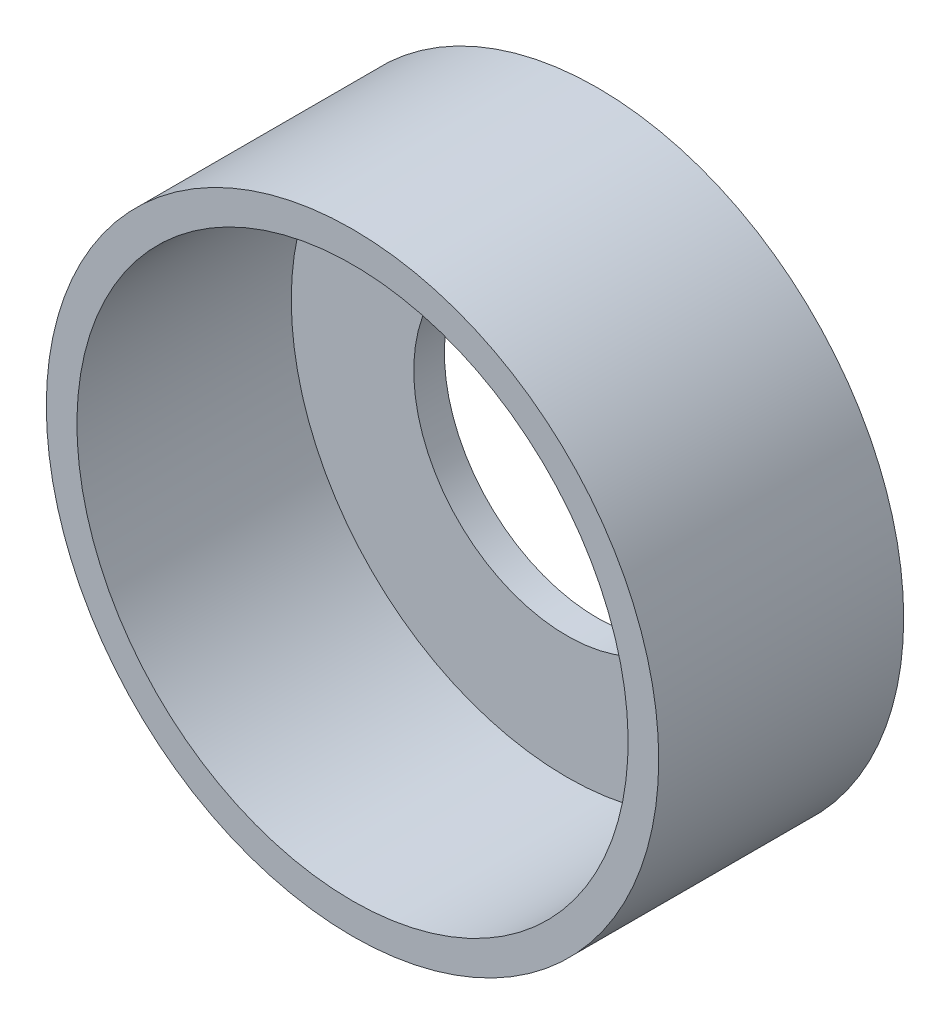
ISO-10303-21;
HEADER;
FILE_DESCRIPTION(('STEP AP214'),'2;1');
FILE_NAME('part.step','',(''),(''),'','','');
FILE_SCHEMA(('AUTOMOTIVE_DESIGN { 1 0 10303 214 1 1 1 1 }'));
ENDSEC;
DATA;
#1=APPLICATION_CONTEXT('core data for automotive mechanical design processes');
#2=APPLICATION_PROTOCOL_DEFINITION('international standard','automotive_design',2000,#1);
#3=PRODUCT_CONTEXT('',#1,'mechanical');
#4=PRODUCT('Part','Part','',(#3));
#5=PRODUCT_RELATED_PRODUCT_CATEGORY('part','',(#4));
#6=PRODUCT_DEFINITION_FORMATION('','',#4);
#7=PRODUCT_DEFINITION_CONTEXT('part definition',#1,'design');
#8=PRODUCT_DEFINITION('design','',#6,#7);
#9=PRODUCT_DEFINITION_SHAPE('','',#8);
#10=(LENGTH_UNIT() NAMED_UNIT(*) SI_UNIT(.MILLI.,.METRE.));
#11=(NAMED_UNIT(*) PLANE_ANGLE_UNIT() SI_UNIT($,.RADIAN.));
#12=(NAMED_UNIT(*) SI_UNIT($,.STERADIAN.) SOLID_ANGLE_UNIT());
#13=UNCERTAINTY_MEASURE_WITH_UNIT(LENGTH_MEASURE(1.E-05),#10,'distance_accuracy_value','');
#14=(GEOMETRIC_REPRESENTATION_CONTEXT(3) GLOBAL_UNCERTAINTY_ASSIGNED_CONTEXT((#13)) GLOBAL_UNIT_ASSIGNED_CONTEXT((#10,
#11,#12)) REPRESENTATION_CONTEXT('',''));
#15=CARTESIAN_POINT('',(0.,0.,0.));
#16=DIRECTION('',(0.,0.,1.));
#17=DIRECTION('',(1.,0.,0.));
#18=AXIS2_PLACEMENT_3D('',#15,#16,#17);
#19=CARTESIAN_POINT('',(0.,0.,6.35));
#20=DIRECTION('',(0.,0.,-1.));
#21=DIRECTION('',(0.,-1.,0.));
#22=AXIS2_PLACEMENT_3D('',#19,#20,#21);
#23=CYLINDRICAL_SURFACE('',#22,14.2875);
#24=CARTESIAN_POINT('',(0.,0.,-4.7625));
#25=DIRECTION('',(0.,0.,1.));
#26=DIRECTION('',(1.,0.,0.));
#27=AXIS2_PLACEMENT_3D('',#24,#25,#26);
#28=CIRCLE('',#27,14.2875);
#29=CARTESIAN_POINT('',(14.2875,0.,-4.7625));
#30=VERTEX_POINT('',#29);
#31=EDGE_CURVE('E8',#30,#30,#28,.T.);
#32=ORIENTED_EDGE('',*,*,#31,.F.);
#33=EDGE_LOOP('',(#32));
#34=FACE_BOUND('',#33,.T.);
#35=CARTESIAN_POINT('',(0.,0.,6.35));
#36=DIRECTION('',(0.,0.,-1.));
#37=DIRECTION('',(0.,-1.,0.));
#38=AXIS2_PLACEMENT_3D('',#35,#36,#37);
#39=CIRCLE('',#38,14.2875);
#40=CARTESIAN_POINT('',(0.,-14.2875,6.35));
#41=VERTEX_POINT('',#40);
#42=EDGE_CURVE('E29',#41,#41,#39,.T.);
#43=ORIENTED_EDGE('',*,*,#42,.F.);
#44=EDGE_LOOP('',(#43));
#45=FACE_BOUND('',#44,.T.);
#46=ADVANCED_FACE('F13',(#34,#45),#23,.F.);
#47=CARTESIAN_POINT('',(0.,0.,-4.7625));
#48=DIRECTION('',(0.,0.,-1.));
#49=DIRECTION('',(-1.,0.,0.));
#50=AXIS2_PLACEMENT_3D('',#47,#48,#49);
#51=PLANE('',#50);
#52=CARTESIAN_POINT('',(0.,0.,-4.7625));
#53=DIRECTION('',(0.,0.,1.));
#54=DIRECTION('',(1.,0.,0.));
#55=AXIS2_PLACEMENT_3D('',#52,#53,#54);
#56=CIRCLE('',#55,7.9375);
#57=CARTESIAN_POINT('',(7.9375,0.,-4.7625));
#58=VERTEX_POINT('',#57);
#59=EDGE_CURVE('E21',#58,#58,#56,.T.);
#60=ORIENTED_EDGE('',*,*,#59,.F.);
#61=EDGE_LOOP('',(#60));
#62=FACE_BOUND('',#61,.T.);
#63=ORIENTED_EDGE('',*,*,#31,.T.);
#64=EDGE_LOOP('',(#63));
#65=FACE_BOUND('',#64,.T.);
#66=ADVANCED_FACE('F53',(#62,#65),#51,.F.);
#67=CARTESIAN_POINT('',(0.,0.,0.));
#68=DIRECTION('',(0.,0.,1.));
#69=DIRECTION('',(1.,0.,0.));
#70=AXIS2_PLACEMENT_3D('',#67,#68,#69);
#71=CYLINDRICAL_SURFACE('',#70,7.9375);
#72=ORIENTED_EDGE('',*,*,#59,.T.);
#73=EDGE_LOOP('',(#72));
#74=FACE_BOUND('',#73,.T.);
#75=CARTESIAN_POINT('',(0.,0.,-6.35));
#76=DIRECTION('',(0.,0.,1.));
#77=DIRECTION('',(1.,0.,0.));
#78=AXIS2_PLACEMENT_3D('',#75,#76,#77);
#79=CIRCLE('',#78,7.9375);
#80=CARTESIAN_POINT('',(7.9375,0.,-6.35));
#81=VERTEX_POINT('',#80);
#82=EDGE_CURVE('E26',#81,#81,#79,.T.);
#83=ORIENTED_EDGE('',*,*,#82,.F.);
#84=EDGE_LOOP('',(#83));
#85=FACE_BOUND('',#84,.T.);
#86=ADVANCED_FACE('F58',(#74,#85),#71,.F.);
#87=CARTESIAN_POINT('',(0.,0.,-6.35));
#88=DIRECTION('',(0.,0.,-1.));
#89=DIRECTION('',(-1.,0.,0.));
#90=AXIS2_PLACEMENT_3D('',#87,#88,#89);
#91=PLANE('',#90);
#92=ORIENTED_EDGE('',*,*,#82,.T.);
#93=EDGE_LOOP('',(#92));
#94=FACE_BOUND('',#93,.T.);
#95=CARTESIAN_POINT('',(0.,0.,-6.35));
#96=DIRECTION('',(0.,0.,1.));
#97=DIRECTION('',(1.,0.,0.));
#98=AXIS2_PLACEMENT_3D('',#95,#96,#97);
#99=CIRCLE('',#98,15.875);
#100=CARTESIAN_POINT('',(15.875,0.,-6.35));
#101=VERTEX_POINT('',#100);
#102=EDGE_CURVE('E33',#101,#101,#99,.T.);
#103=ORIENTED_EDGE('',*,*,#102,.F.);
#104=EDGE_LOOP('',(#103));
#105=FACE_BOUND('',#104,.T.);
#106=ADVANCED_FACE('F49',(#94,#105),#91,.T.);
#107=CARTESIAN_POINT('',(0.,0.,0.));
#108=DIRECTION('',(0.,0.,1.));
#109=DIRECTION('',(1.,0.,0.));
#110=AXIS2_PLACEMENT_3D('',#107,#108,#109);
#111=CYLINDRICAL_SURFACE('',#110,15.875);
#112=ORIENTED_EDGE('',*,*,#102,.T.);
#113=EDGE_LOOP('',(#112));
#114=FACE_BOUND('',#113,.T.);
#115=CARTESIAN_POINT('',(0.,0.,6.35));
#116=DIRECTION('',(0.,0.,-1.));
#117=DIRECTION('',(0.,-1.,0.));
#118=AXIS2_PLACEMENT_3D('',#115,#116,#117);
#119=CIRCLE('',#118,15.875);
#120=CARTESIAN_POINT('',(0.,-15.875,6.35));
#121=VERTEX_POINT('',#120);
#122=EDGE_CURVE('E17',#121,#121,#119,.T.);
#123=ORIENTED_EDGE('',*,*,#122,.T.);
#124=EDGE_LOOP('',(#123));
#125=FACE_BOUND('',#124,.T.);
#126=ADVANCED_FACE('F15',(#114,#125),#111,.T.);
#127=CARTESIAN_POINT('',(0.,0.,6.35));
#128=DIRECTION('',(0.,0.,-1.));
#129=DIRECTION('',(-1.,0.,0.));
#130=AXIS2_PLACEMENT_3D('',#127,#128,#129);
#131=PLANE('',#130);
#132=ORIENTED_EDGE('',*,*,#42,.T.);
#133=EDGE_LOOP('',(#132));
#134=FACE_BOUND('',#133,.T.);
#135=ORIENTED_EDGE('',*,*,#122,.F.);
#136=EDGE_LOOP('',(#135));
#137=FACE_BOUND('',#136,.T.);
#138=ADVANCED_FACE('F41',(#134,#137),#131,.F.);
#139=CLOSED_SHELL('',(#46,#66,#86,#106,#126,#138));
#140=MANIFOLD_SOLID_BREP('B1',#139);
#141=ADVANCED_BREP_SHAPE_REPRESENTATION('',(#18,#140),#14);
#142=SHAPE_DEFINITION_REPRESENTATION(#9,#141);
ENDSEC;
END-ISO-10303-21;
